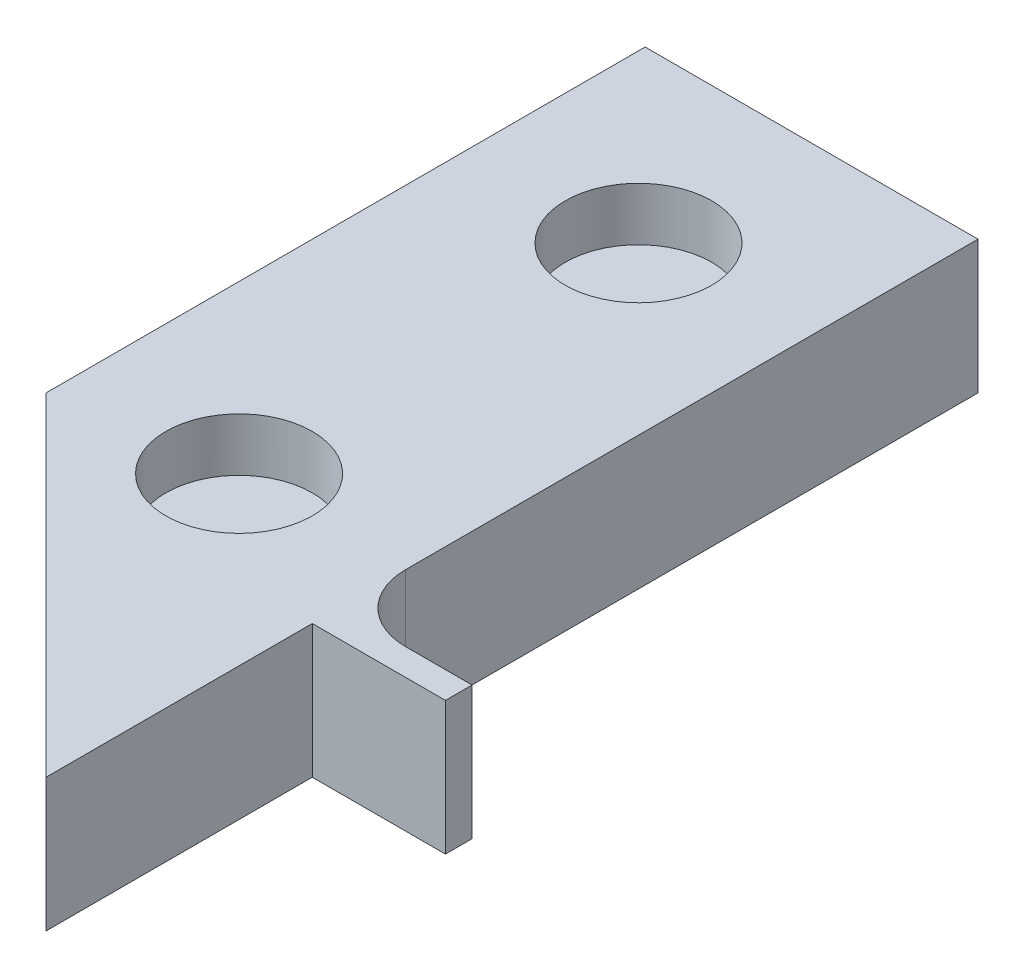
ISO-10303-21;
HEADER;
FILE_DESCRIPTION(('STEP AP214'),'2;1');
FILE_NAME('part.step','',(''),(''),'','','');
FILE_SCHEMA(('AUTOMOTIVE_DESIGN { 1 0 10303 214 1 1 1 1 }'));
ENDSEC;
DATA;
#1=APPLICATION_CONTEXT('core data for automotive mechanical design processes');
#2=APPLICATION_PROTOCOL_DEFINITION('international standard','automotive_design',2000,#1);
#3=PRODUCT_CONTEXT('',#1,'mechanical');
#4=PRODUCT('Part','Part','',(#3));
#5=PRODUCT_RELATED_PRODUCT_CATEGORY('part','',(#4));
#6=PRODUCT_DEFINITION_FORMATION('','',#4);
#7=PRODUCT_DEFINITION_CONTEXT('part definition',#1,'design');
#8=PRODUCT_DEFINITION('design','',#6,#7);
#9=PRODUCT_DEFINITION_SHAPE('','',#8);
#10=(LENGTH_UNIT() NAMED_UNIT(*) SI_UNIT(.MILLI.,.METRE.));
#11=(NAMED_UNIT(*) PLANE_ANGLE_UNIT() SI_UNIT($,.RADIAN.));
#12=(NAMED_UNIT(*) SI_UNIT($,.STERADIAN.) SOLID_ANGLE_UNIT());
#13=UNCERTAINTY_MEASURE_WITH_UNIT(LENGTH_MEASURE(1.E-05),#10,'distance_accuracy_value','');
#14=(GEOMETRIC_REPRESENTATION_CONTEXT(3) GLOBAL_UNCERTAINTY_ASSIGNED_CONTEXT((#13)) GLOBAL_UNIT_ASSIGNED_CONTEXT((#10,
#11,#12)) REPRESENTATION_CONTEXT('',''));
#15=CARTESIAN_POINT('',(0.,0.,0.));
#16=DIRECTION('',(0.,0.,1.));
#17=DIRECTION('',(1.,0.,0.));
#18=AXIS2_PLACEMENT_3D('',#15,#16,#17);
#19=CARTESIAN_POINT('',(0.,-20.,-140.));
#20=DIRECTION('',(-1.,0.,0.));
#21=DIRECTION('',(0.,0.,1.));
#22=AXIS2_PLACEMENT_3D('',#19,#20,#21);
#23=PLANE('',#22);
#24=DIRECTION('',(0.,1.,0.));
#25=VECTOR('',#24,1.);
#26=CARTESIAN_POINT('',(0.,-20.,-40.));
#27=LINE('',#26,#25);
#28=CARTESIAN_POINT('',(0.,-20.,-40.));
#29=VERTEX_POINT('',#28);
#30=CARTESIAN_POINT('',(0.,0.,-40.));
#31=VERTEX_POINT('',#30);
#32=EDGE_CURVE('E231',#29,#31,#27,.T.);
#33=ORIENTED_EDGE('',*,*,#32,.T.);
#34=DIRECTION('',(0.,0.,-1.));
#35=VECTOR('',#34,1.);
#36=CARTESIAN_POINT('',(0.,0.,-140.));
#37=LINE('',#36,#35);
#38=CARTESIAN_POINT('',(0.,0.,0.));
#39=VERTEX_POINT('',#38);
#40=EDGE_CURVE('E178',#39,#31,#37,.T.);
#41=ORIENTED_EDGE('',*,*,#40,.F.);
#42=DIRECTION('',(0.,1.,0.));
#43=VECTOR('',#42,1.);
#44=CARTESIAN_POINT('',(0.,-20.,0.));
#45=LINE('',#44,#43);
#46=CARTESIAN_POINT('',(0.,-20.,0.));
#47=VERTEX_POINT('',#46);
#48=EDGE_CURVE('E194',#47,#39,#45,.T.);
#49=ORIENTED_EDGE('',*,*,#48,.F.);
#50=DIRECTION('',(0.,0.,-1.));
#51=VECTOR('',#50,1.);
#52=CARTESIAN_POINT('',(0.,-20.,-140.));
#53=LINE('',#52,#51);
#54=EDGE_CURVE('E258',#47,#29,#53,.T.);
#55=ORIENTED_EDGE('',*,*,#54,.T.);
#56=EDGE_LOOP('',(#33,#41,#49,#55));
#57=FACE_BOUND('',#56,.T.);
#58=ADVANCED_FACE('F39',(#57),#23,.F.);
#59=CARTESIAN_POINT('',(0.,-20.,-54.));
#60=VERTEX_POINT('',#59);
#61=CARTESIAN_POINT('',(0.,-20.,-140.));
#62=VERTEX_POINT('',#61);
#63=EDGE_CURVE('E257',#60,#62,#53,.T.);
#64=ORIENTED_EDGE('',*,*,#63,.T.);
#65=DIRECTION('',(0.,1.,0.));
#66=VECTOR('',#65,1.);
#67=CARTESIAN_POINT('',(0.,-20.,-140.));
#68=LINE('',#67,#66);
#69=CARTESIAN_POINT('',(0.,0.,-140.));
#70=VERTEX_POINT('',#69);
#71=EDGE_CURVE('E177',#62,#70,#68,.T.);
#72=ORIENTED_EDGE('',*,*,#71,.T.);
#73=CARTESIAN_POINT('',(0.,0.,-54.));
#74=VERTEX_POINT('',#73);
#75=EDGE_CURVE('E174',#74,#70,#37,.T.);
#76=ORIENTED_EDGE('',*,*,#75,.F.);
#77=DIRECTION('',(0.,-1.,0.));
#78=VECTOR('',#77,1.);
#79=CARTESIAN_POINT('',(0.,0.,-54.));
#80=LINE('',#79,#78);
#81=EDGE_CURVE('E163',#60,#74,#80,.F.);
#82=ORIENTED_EDGE('',*,*,#81,.F.);
#83=EDGE_LOOP('',(#64,#72,#76,#82));
#84=FACE_BOUND('',#83,.T.);
#85=ADVANCED_FACE('F175',(#84),#23,.F.);
#86=CARTESIAN_POINT('',(-50.,-20.,-140.));
#87=DIRECTION('',(1.,0.,0.));
#88=DIRECTION('',(0.,0.,-1.));
#89=AXIS2_PLACEMENT_3D('',#86,#87,#88);
#90=PLANE('',#89);
#91=DIRECTION('',(0.,0.,1.));
#92=VECTOR('',#91,1.);
#93=CARTESIAN_POINT('',(-50.,0.,-140.));
#94=LINE('',#93,#92);
#95=CARTESIAN_POINT('',(-50.,0.,-140.));
#96=VERTEX_POINT('',#95);
#97=CARTESIAN_POINT('',(-50.,0.,-49.9999999999998));
#98=VERTEX_POINT('',#97);
#99=EDGE_CURVE('E183',#96,#98,#94,.T.);
#100=ORIENTED_EDGE('',*,*,#99,.F.);
#101=DIRECTION('',(0.,1.,0.));
#102=VECTOR('',#101,1.);
#103=CARTESIAN_POINT('',(-50.,-20.,-140.));
#104=LINE('',#103,#102);
#105=CARTESIAN_POINT('',(-50.,-20.,-140.));
#106=VERTEX_POINT('',#105);
#107=EDGE_CURVE('E189',#106,#96,#104,.T.);
#108=ORIENTED_EDGE('',*,*,#107,.F.);
#109=DIRECTION('',(0.,0.,1.));
#110=VECTOR('',#109,1.);
#111=CARTESIAN_POINT('',(-50.,-20.,-140.));
#112=LINE('',#111,#110);
#113=CARTESIAN_POINT('',(-50.,-20.,-49.9999999999998));
#114=VERTEX_POINT('',#113);
#115=EDGE_CURVE('E188',#106,#114,#112,.T.);
#116=ORIENTED_EDGE('',*,*,#115,.T.);
#117=DIRECTION('',(0.,1.,0.));
#118=VECTOR('',#117,1.);
#119=CARTESIAN_POINT('',(-50.,-20.,-49.9999999999998));
#120=LINE('',#119,#118);
#121=EDGE_CURVE('E197',#114,#98,#120,.T.);
#122=ORIENTED_EDGE('',*,*,#121,.T.);
#123=EDGE_LOOP('',(#100,#108,#116,#122));
#124=FACE_BOUND('',#123,.T.);
#125=ADVANCED_FACE('F266',(#124),#90,.F.);
#126=CARTESIAN_POINT('',(-50.,-20.,-49.9999999999998));
#127=DIRECTION('',(0.707106781186546,0.,-0.707106781186549));
#128=DIRECTION('',(-0.707106781186549,0.,-0.707106781186546));
#129=AXIS2_PLACEMENT_3D('',#126,#127,#128);
#130=PLANE('',#129);
#131=DIRECTION('',(-0.707106781186549,0.,-0.707106781186546));
#132=VECTOR('',#131,1.);
#133=CARTESIAN_POINT('',(-50.,-4.,-49.9999999999998));
#134=LINE('',#133,#132);
#135=CARTESIAN_POINT('',(-4.00000000000001,-4.,-4.));
#136=VERTEX_POINT('',#135);
#137=CARTESIAN_POINT('',(-46.,-4.,-45.9999999999998));
#138=VERTEX_POINT('',#137);
#139=EDGE_CURVE('E203',#136,#138,#134,.T.);
#140=ORIENTED_EDGE('',*,*,#139,.F.);
#141=DIRECTION('',(0.,-1.,0.));
#142=VECTOR('',#141,1.);
#143=CARTESIAN_POINT('',(-4.00000000000001,-20.,-4.));
#144=LINE('',#143,#142);
#145=CARTESIAN_POINT('',(-4.,-16.,-4.));
#146=VERTEX_POINT('',#145);
#147=EDGE_CURVE('E200',#136,#146,#144,.T.);
#148=ORIENTED_EDGE('',*,*,#147,.T.);
#149=DIRECTION('',(0.707106781186549,0.,0.707106781186546));
#150=VECTOR('',#149,1.);
#151=CARTESIAN_POINT('',(-50.,-16.,-49.9999999999998));
#152=LINE('',#151,#150);
#153=CARTESIAN_POINT('',(-46.,-16.,-45.9999999999998));
#154=VERTEX_POINT('',#153);
#155=EDGE_CURVE('E206',#154,#146,#152,.T.);
#156=ORIENTED_EDGE('',*,*,#155,.F.);
#157=DIRECTION('',(0.,-1.,0.));
#158=VECTOR('',#157,1.);
#159=CARTESIAN_POINT('',(-46.,-20.,-45.9999999999998));
#160=LINE('',#159,#158);
#161=EDGE_CURVE('E165',#138,#154,#160,.T.);
#162=ORIENTED_EDGE('',*,*,#161,.F.);
#163=EDGE_LOOP('',(#140,#148,#156,#162));
#164=FACE_BOUND('',#163,.T.);
#165=DIRECTION('',(0.707106781186549,0.,0.707106781186546));
#166=VECTOR('',#165,1.);
#167=CARTESIAN_POINT('',(-50.,0.,-49.9999999999998));
#168=LINE('',#167,#166);
#169=EDGE_CURVE('E179',#98,#39,#168,.T.);
#170=ORIENTED_EDGE('',*,*,#169,.F.);
#171=ORIENTED_EDGE('',*,*,#121,.F.);
#172=DIRECTION('',(0.707106781186549,0.,0.707106781186546));
#173=VECTOR('',#172,1.);
#174=CARTESIAN_POINT('',(-50.,-20.,-49.9999999999998));
#175=LINE('',#174,#173);
#176=EDGE_CURVE('E255',#114,#47,#175,.T.);
#177=ORIENTED_EDGE('',*,*,#176,.T.);
#178=ORIENTED_EDGE('',*,*,#48,.T.);
#179=EDGE_LOOP('',(#170,#171,#177,#178));
#180=FACE_BOUND('',#179,.T.);
#181=ADVANCED_FACE('F216',(#164,#180),#130,.F.);
#182=CARTESIAN_POINT('',(-50.,-20.,-140.));
#183=DIRECTION('',(0.,0.,1.));
#184=DIRECTION('',(1.,0.,0.));
#185=AXIS2_PLACEMENT_3D('',#182,#183,#184);
#186=PLANE('',#185);
#187=DIRECTION('',(-1.,0.,0.));
#188=VECTOR('',#187,1.);
#189=CARTESIAN_POINT('',(-50.,0.,-140.));
#190=LINE('',#189,#188);
#191=EDGE_CURVE('E182',#70,#96,#190,.T.);
#192=ORIENTED_EDGE('',*,*,#191,.F.);
#193=ORIENTED_EDGE('',*,*,#71,.F.);
#194=DIRECTION('',(-1.,0.,0.));
#195=VECTOR('',#194,1.);
#196=CARTESIAN_POINT('',(-50.,-20.,-140.));
#197=LINE('',#196,#195);
#198=EDGE_CURVE('E192',#62,#106,#197,.T.);
#199=ORIENTED_EDGE('',*,*,#198,.T.);
#200=ORIENTED_EDGE('',*,*,#107,.T.);
#201=EDGE_LOOP('',(#192,#193,#199,#200));
#202=FACE_BOUND('',#201,.T.);
#203=ADVANCED_FACE('F289',(#202),#186,.F.);
#204=CARTESIAN_POINT('',(0.,-20.,0.));
#205=DIRECTION('',(0.,-1.,0.));
#206=DIRECTION('',(0.,0.,1.));
#207=AXIS2_PLACEMENT_3D('',#204,#205,#206);
#208=PLANE('',#207);
#209=ORIENTED_EDGE('',*,*,#115,.F.);
#210=ORIENTED_EDGE('',*,*,#198,.F.);
#211=ORIENTED_EDGE('',*,*,#63,.F.);
#212=CARTESIAN_POINT('',(10.,-20.,-54.));
#213=DIRECTION('',(0.,1.,0.));
#214=DIRECTION('',(0.,0.,1.));
#215=AXIS2_PLACEMENT_3D('',#212,#213,#214);
#216=CIRCLE('',#215,10.);
#217=CARTESIAN_POINT('',(10.,-20.,-44.));
#218=VERTEX_POINT('',#217);
#219=EDGE_CURVE('E47',#218,#60,#216,.F.);
#220=ORIENTED_EDGE('',*,*,#219,.F.);
#221=DIRECTION('',(-1.,0.,0.));
#222=VECTOR('',#221,1.);
#223=CARTESIAN_POINT('',(20.,-20.,-44.));
#224=LINE('',#223,#222);
#225=CARTESIAN_POINT('',(20.,-20.,-44.));
#226=VERTEX_POINT('',#225);
#227=EDGE_CURVE('E246',#226,#218,#224,.T.);
#228=ORIENTED_EDGE('',*,*,#227,.F.);
#229=DIRECTION('',(0.,0.,1.));
#230=VECTOR('',#229,1.);
#231=CARTESIAN_POINT('',(20.,-20.,-40.));
#232=LINE('',#231,#230);
#233=CARTESIAN_POINT('',(20.,-20.,-40.));
#234=VERTEX_POINT('',#233);
#235=EDGE_CURVE('E239',#226,#234,#232,.T.);
#236=ORIENTED_EDGE('',*,*,#235,.T.);
#237=DIRECTION('',(-1.,0.,0.));
#238=VECTOR('',#237,1.);
#239=CARTESIAN_POINT('',(20.,-20.,-40.));
#240=LINE('',#239,#238);
#241=EDGE_CURVE('E242',#234,#29,#240,.T.);
#242=ORIENTED_EDGE('',*,*,#241,.T.);
#243=ORIENTED_EDGE('',*,*,#54,.F.);
#244=ORIENTED_EDGE('',*,*,#176,.F.);
#245=EDGE_LOOP('',(#209,#210,#211,#220,#228,#236,#242,#243,#244));
#246=FACE_BOUND('',#245,.T.);
#247=ADVANCED_FACE('F287',(#246),#208,.T.);
#248=CARTESIAN_POINT('',(0.,0.,0.));
#249=DIRECTION('',(0.,-1.,0.));
#250=DIRECTION('',(0.,0.,1.));
#251=AXIS2_PLACEMENT_3D('',#248,#249,#250);
#252=PLANE('',#251);
#253=CARTESIAN_POINT('',(-25.,0.,-54.));
#254=DIRECTION('',(0.,-1.,0.));
#255=DIRECTION('',(0.,0.,-1.));
#256=AXIS2_PLACEMENT_3D('',#253,#254,#255);
#257=CIRCLE('',#256,11.);
#258=CARTESIAN_POINT('',(-25.,0.,-65.));
#259=VERTEX_POINT('',#258);
#260=EDGE_CURVE('E149',#259,#259,#257,.T.);
#261=ORIENTED_EDGE('',*,*,#260,.T.);
#262=EDGE_LOOP('',(#261));
#263=FACE_BOUND('',#262,.T.);
#264=CARTESIAN_POINT('',(-25.,0.,-114.));
#265=DIRECTION('',(0.,-1.,0.));
#266=DIRECTION('',(0.,0.,-1.));
#267=AXIS2_PLACEMENT_3D('',#264,#265,#266);
#268=CIRCLE('',#267,11.);
#269=CARTESIAN_POINT('',(-25.,0.,-125.));
#270=VERTEX_POINT('',#269);
#271=EDGE_CURVE('E444',#270,#270,#268,.T.);
#272=ORIENTED_EDGE('',*,*,#271,.T.);
#273=EDGE_LOOP('',(#272));
#274=FACE_BOUND('',#273,.T.);
#275=ORIENTED_EDGE('',*,*,#99,.T.);
#276=ORIENTED_EDGE('',*,*,#169,.T.);
#277=ORIENTED_EDGE('',*,*,#40,.T.);
#278=DIRECTION('',(-1.,0.,0.));
#279=VECTOR('',#278,1.);
#280=CARTESIAN_POINT('',(20.,0.,-40.));
#281=LINE('',#280,#279);
#282=CARTESIAN_POINT('',(20.,0.,-40.));
#283=VERTEX_POINT('',#282);
#284=EDGE_CURVE('E251',#283,#31,#281,.T.);
#285=ORIENTED_EDGE('',*,*,#284,.F.);
#286=DIRECTION('',(0.,0.,-1.));
#287=VECTOR('',#286,1.);
#288=CARTESIAN_POINT('',(20.,0.,-40.));
#289=LINE('',#288,#287);
#290=CARTESIAN_POINT('',(20.,0.,-44.));
#291=VERTEX_POINT('',#290);
#292=EDGE_CURVE('E234',#283,#291,#289,.T.);
#293=ORIENTED_EDGE('',*,*,#292,.T.);
#294=DIRECTION('',(-1.,0.,0.));
#295=VECTOR('',#294,1.);
#296=CARTESIAN_POINT('',(20.,0.,-44.));
#297=LINE('',#296,#295);
#298=CARTESIAN_POINT('',(10.,0.,-44.));
#299=VERTEX_POINT('',#298);
#300=EDGE_CURVE('E249',#291,#299,#297,.T.);
#301=ORIENTED_EDGE('',*,*,#300,.T.);
#302=CARTESIAN_POINT('',(10.,0.,-54.));
#303=DIRECTION('',(0.,1.,0.));
#304=DIRECTION('',(0.,0.,1.));
#305=AXIS2_PLACEMENT_3D('',#302,#303,#304);
#306=CIRCLE('',#305,10.);
#307=EDGE_CURVE('E12',#74,#299,#306,.T.);
#308=ORIENTED_EDGE('',*,*,#307,.F.);
#309=ORIENTED_EDGE('',*,*,#75,.T.);
#310=ORIENTED_EDGE('',*,*,#191,.T.);
#311=EDGE_LOOP('',(#275,#276,#277,#285,#293,#301,#308,#309,#310));
#312=FACE_BOUND('',#311,.T.);
#313=ADVANCED_FACE('F263',(#263,#274,#312),#252,.F.);
#314=CARTESIAN_POINT('',(20.,-20.,-40.));
#315=DIRECTION('',(0.,0.,-1.));
#316=DIRECTION('',(-1.,0.,0.));
#317=AXIS2_PLACEMENT_3D('',#314,#315,#316);
#318=PLANE('',#317);
#319=ORIENTED_EDGE('',*,*,#32,.F.);
#320=ORIENTED_EDGE('',*,*,#241,.F.);
#321=DIRECTION('',(0.,1.,0.));
#322=VECTOR('',#321,1.);
#323=CARTESIAN_POINT('',(20.,-20.,-40.));
#324=LINE('',#323,#322);
#325=EDGE_CURVE('E232',#234,#283,#324,.T.);
#326=ORIENTED_EDGE('',*,*,#325,.T.);
#327=ORIENTED_EDGE('',*,*,#284,.T.);
#328=EDGE_LOOP('',(#319,#320,#326,#327));
#329=FACE_BOUND('',#328,.T.);
#330=ADVANCED_FACE('F277',(#329),#318,.F.);
#331=CARTESIAN_POINT('',(20.,-20.,-44.));
#332=DIRECTION('',(0.,0.,1.));
#333=DIRECTION('',(1.,0.,0.));
#334=AXIS2_PLACEMENT_3D('',#331,#332,#333);
#335=PLANE('',#334);
#336=ORIENTED_EDGE('',*,*,#300,.F.);
#337=DIRECTION('',(0.,-1.,0.));
#338=VECTOR('',#337,1.);
#339=CARTESIAN_POINT('',(20.,-20.,-44.));
#340=LINE('',#339,#338);
#341=EDGE_CURVE('E237',#291,#226,#340,.T.);
#342=ORIENTED_EDGE('',*,*,#341,.T.);
#343=ORIENTED_EDGE('',*,*,#227,.T.);
#344=DIRECTION('',(0.,-1.,0.));
#345=VECTOR('',#344,1.);
#346=CARTESIAN_POINT('',(10.,-20.,-44.));
#347=LINE('',#346,#345);
#348=EDGE_CURVE('E160',#299,#218,#347,.T.);
#349=ORIENTED_EDGE('',*,*,#348,.F.);
#350=EDGE_LOOP('',(#336,#342,#343,#349));
#351=FACE_BOUND('',#350,.T.);
#352=ADVANCED_FACE('F285',(#351),#335,.F.);
#353=CARTESIAN_POINT('',(20.,0.,0.));
#354=DIRECTION('',(1.,0.,0.));
#355=DIRECTION('',(0.,0.,-1.));
#356=AXIS2_PLACEMENT_3D('',#353,#354,#355);
#357=PLANE('',#356);
#358=ORIENTED_EDGE('',*,*,#325,.F.);
#359=ORIENTED_EDGE('',*,*,#235,.F.);
#360=ORIENTED_EDGE('',*,*,#341,.F.);
#361=ORIENTED_EDGE('',*,*,#292,.F.);
#362=EDGE_LOOP('',(#358,#359,#360,#361));
#363=FACE_BOUND('',#362,.T.);
#364=ADVANCED_FACE('F281',(#363),#357,.T.);
#365=CARTESIAN_POINT('',(47.5394572960187,-16.,-45.9999999999998));
#366=DIRECTION('',(0.,0.,-1.));
#367=DIRECTION('',(-1.,0.,0.));
#368=AXIS2_PLACEMENT_3D('',#365,#366,#367);
#369=PLANE('',#368);
#370=DIRECTION('',(-1.,0.,0.));
#371=VECTOR('',#370,1.);
#372=CARTESIAN_POINT('',(47.5394572960187,-8.,-45.9999999999998));
#373=LINE('',#372,#371);
#374=CARTESIAN_POINT('',(-17.4501655647295,-8.,-45.9999999999998));
#375=VERTEX_POINT('',#374);
#376=CARTESIAN_POINT('',(-32.5498344352705,-8.,-45.9999999999998));
#377=VERTEX_POINT('',#376);
#378=EDGE_CURVE('E153',#375,#377,#373,.T.);
#379=ORIENTED_EDGE('',*,*,#378,.T.);
#380=DIRECTION('',(0.,1.,0.));
#381=VECTOR('',#380,1.);
#382=CARTESIAN_POINT('',(-32.5498344352705,-8.,-45.9999999999998));
#383=LINE('',#382,#381);
#384=CARTESIAN_POINT('',(-32.5498344352705,-4.,-45.9999999999998));
#385=VERTEX_POINT('',#384);
#386=EDGE_CURVE('E145',#385,#377,#383,.F.);
#387=ORIENTED_EDGE('',*,*,#386,.F.);
#388=DIRECTION('',(-1.,0.,0.));
#389=VECTOR('',#388,1.);
#390=CARTESIAN_POINT('',(47.5394572960187,-4.,-45.9999999999998));
#391=LINE('',#390,#389);
#392=EDGE_CURVE('E157',#385,#138,#391,.T.);
#393=ORIENTED_EDGE('',*,*,#392,.T.);
#394=ORIENTED_EDGE('',*,*,#161,.T.);
#395=DIRECTION('',(-1.,0.,0.));
#396=VECTOR('',#395,1.);
#397=CARTESIAN_POINT('',(47.5394572960187,-16.,-45.9999999999998));
#398=LINE('',#397,#396);
#399=CARTESIAN_POINT('',(-4.,-16.,-45.9999999999998));
#400=VERTEX_POINT('',#399);
#401=EDGE_CURVE('E212',#400,#154,#398,.T.);
#402=ORIENTED_EDGE('',*,*,#401,.F.);
#403=DIRECTION('',(0.,-1.,0.));
#404=VECTOR('',#403,1.);
#405=CARTESIAN_POINT('',(-4.,-16.,-45.9999999999998));
#406=LINE('',#405,#404);
#407=CARTESIAN_POINT('',(-4.,-4.,-45.9999999999998));
#408=VERTEX_POINT('',#407);
#409=EDGE_CURVE('E224',#408,#400,#406,.T.);
#410=ORIENTED_EDGE('',*,*,#409,.F.);
#411=CARTESIAN_POINT('',(-17.4501655647295,-4.,-45.9999999999998));
#412=VERTEX_POINT('',#411);
#413=EDGE_CURVE('E156',#408,#412,#391,.T.);
#414=ORIENTED_EDGE('',*,*,#413,.T.);
#415=DIRECTION('',(0.,1.,0.));
#416=VECTOR('',#415,1.);
#417=CARTESIAN_POINT('',(-17.4501655647295,-8.,-45.9999999999998));
#418=LINE('',#417,#416);
#419=EDGE_CURVE('E142',#375,#412,#418,.T.);
#420=ORIENTED_EDGE('',*,*,#419,.F.);
#421=EDGE_LOOP('',(#379,#387,#393,#394,#402,#410,#414,#420));
#422=FACE_BOUND('',#421,.T.);
#423=ADVANCED_FACE('F152',(#422),#369,.F.);
#424=CARTESIAN_POINT('',(47.5394572960187,-16.,-45.9999999999998));
#425=DIRECTION('',(0.,-1.,0.));
#426=DIRECTION('',(0.,0.,1.));
#427=AXIS2_PLACEMENT_3D('',#424,#425,#426);
#428=PLANE('',#427);
#429=ORIENTED_EDGE('',*,*,#401,.T.);
#430=ORIENTED_EDGE('',*,*,#155,.T.);
#431=DIRECTION('',(0.,0.,1.));
#432=VECTOR('',#431,1.);
#433=CARTESIAN_POINT('',(-4.,-16.,-45.9999999999998));
#434=LINE('',#433,#432);
#435=EDGE_CURVE('E221',#400,#146,#434,.T.);
#436=ORIENTED_EDGE('',*,*,#435,.F.);
#437=EDGE_LOOP('',(#429,#430,#436));
#438=FACE_BOUND('',#437,.T.);
#439=ADVANCED_FACE('F220',(#438),#428,.F.);
#440=CARTESIAN_POINT('',(47.5394572960187,-4.,-45.9999999999998));
#441=DIRECTION('',(0.,1.,0.));
#442=DIRECTION('',(0.,0.,-1.));
#443=AXIS2_PLACEMENT_3D('',#440,#441,#442);
#444=PLANE('',#443);
#445=ORIENTED_EDGE('',*,*,#413,.F.);
#446=DIRECTION('',(0.,0.,-1.));
#447=VECTOR('',#446,1.);
#448=CARTESIAN_POINT('',(-4.,-4.,-45.9999999999998));
#449=LINE('',#448,#447);
#450=EDGE_CURVE('E229',#136,#408,#449,.T.);
#451=ORIENTED_EDGE('',*,*,#450,.F.);
#452=ORIENTED_EDGE('',*,*,#139,.T.);
#453=ORIENTED_EDGE('',*,*,#392,.F.);
#454=CARTESIAN_POINT('',(-25.,-4.,-54.));
#455=DIRECTION('',(0.,-1.,0.));
#456=DIRECTION('',(0.,0.,-1.));
#457=AXIS2_PLACEMENT_3D('',#454,#455,#456);
#458=CIRCLE('',#457,11.);
#459=EDGE_CURVE('E161',#412,#385,#458,.T.);
#460=ORIENTED_EDGE('',*,*,#459,.F.);
#461=EDGE_LOOP('',(#445,#451,#452,#453,#460));
#462=FACE_BOUND('',#461,.T.);
#463=ADVANCED_FACE('F374',(#462),#444,.F.);
#464=CARTESIAN_POINT('',(-4.,-20.,-140.));
#465=DIRECTION('',(-1.,0.,0.));
#466=DIRECTION('',(0.,0.,1.));
#467=AXIS2_PLACEMENT_3D('',#464,#465,#466);
#468=PLANE('',#467);
#469=ORIENTED_EDGE('',*,*,#147,.F.);
#470=ORIENTED_EDGE('',*,*,#450,.T.);
#471=ORIENTED_EDGE('',*,*,#409,.T.);
#472=ORIENTED_EDGE('',*,*,#435,.T.);
#473=EDGE_LOOP('',(#469,#470,#471,#472));
#474=FACE_BOUND('',#473,.T.);
#475=ADVANCED_FACE('F383',(#474),#468,.T.);
#476=CARTESIAN_POINT('',(-25.,-8.,-54.));
#477=DIRECTION('',(0.,1.,0.));
#478=DIRECTION('',(0.,0.,-1.));
#479=AXIS2_PLACEMENT_3D('',#476,#477,#478);
#480=PLANE('',#479);
#481=ORIENTED_EDGE('',*,*,#378,.F.);
#482=CARTESIAN_POINT('',(-25.,-8.,-54.));
#483=DIRECTION('',(0.,-1.,0.));
#484=DIRECTION('',(0.,0.,-1.));
#485=AXIS2_PLACEMENT_3D('',#482,#483,#484);
#486=CIRCLE('',#485,11.);
#487=EDGE_CURVE('E139',#377,#375,#486,.T.);
#488=ORIENTED_EDGE('',*,*,#487,.F.);
#489=EDGE_LOOP('',(#481,#488));
#490=FACE_BOUND('',#489,.T.);
#491=ADVANCED_FACE('F159',(#490),#480,.T.);
#492=CARTESIAN_POINT('',(-25.,-8.,-54.));
#493=DIRECTION('',(0.,1.,0.));
#494=DIRECTION('',(0.,0.,-1.));
#495=AXIS2_PLACEMENT_3D('',#492,#493,#494);
#496=CYLINDRICAL_SURFACE('',#495,11.);
#497=ORIENTED_EDGE('',*,*,#260,.F.);
#498=EDGE_LOOP('',(#497));
#499=FACE_BOUND('',#498,.T.);
#500=ORIENTED_EDGE('',*,*,#487,.T.);
#501=ORIENTED_EDGE('',*,*,#419,.T.);
#502=ORIENTED_EDGE('',*,*,#459,.T.);
#503=ORIENTED_EDGE('',*,*,#386,.T.);
#504=EDGE_LOOP('',(#500,#501,#502,#503));
#505=FACE_BOUND('',#504,.T.);
#506=ADVANCED_FACE('F141',(#499,#505),#496,.F.);
#507=CARTESIAN_POINT('',(-25.,-8.,-114.));
#508=DIRECTION('',(0.,1.,0.));
#509=DIRECTION('',(0.,0.,-1.));
#510=AXIS2_PLACEMENT_3D('',#507,#508,#509);
#511=CYLINDRICAL_SURFACE('',#510,11.);
#512=CARTESIAN_POINT('',(-25.,-8.,-114.));
#513=DIRECTION('',(0.,-1.,0.));
#514=DIRECTION('',(0.,0.,-1.));
#515=AXIS2_PLACEMENT_3D('',#512,#513,#514);
#516=CIRCLE('',#515,11.);
#517=CARTESIAN_POINT('',(-25.,-8.,-125.));
#518=VERTEX_POINT('',#517);
#519=EDGE_CURVE('E443',#518,#518,#516,.T.);
#520=ORIENTED_EDGE('',*,*,#519,.T.);
#521=EDGE_LOOP('',(#520));
#522=FACE_BOUND('',#521,.T.);
#523=ORIENTED_EDGE('',*,*,#271,.F.);
#524=EDGE_LOOP('',(#523));
#525=FACE_BOUND('',#524,.T.);
#526=ADVANCED_FACE('F410',(#522,#525),#511,.F.);
#527=CARTESIAN_POINT('',(-25.,-8.,-114.));
#528=DIRECTION('',(0.,1.,0.));
#529=DIRECTION('',(0.,0.,-1.));
#530=AXIS2_PLACEMENT_3D('',#527,#528,#529);
#531=PLANE('',#530);
#532=ORIENTED_EDGE('',*,*,#519,.F.);
#533=EDGE_LOOP('',(#532));
#534=FACE_BOUND('',#533,.T.);
#535=ADVANCED_FACE('F420',(#534),#531,.T.);
#536=CARTESIAN_POINT('',(10.,-20.,-54.));
#537=DIRECTION('',(0.,1.,0.));
#538=DIRECTION('',(0.,0.,-1.));
#539=AXIS2_PLACEMENT_3D('',#536,#537,#538);
#540=CYLINDRICAL_SURFACE('',#539,10.);
#541=ORIENTED_EDGE('',*,*,#307,.T.);
#542=ORIENTED_EDGE('',*,*,#348,.T.);
#543=ORIENTED_EDGE('',*,*,#219,.T.);
#544=ORIENTED_EDGE('',*,*,#81,.T.);
#545=EDGE_LOOP('',(#541,#542,#543,#544));
#546=FACE_BOUND('',#545,.T.);
#547=ADVANCED_FACE('F41',(#546),#540,.F.);
#548=CLOSED_SHELL('',(#58,#85,#125,#181,#203,#247,#313,#330,#352,#364,#423,#439,#463,#475,#491,
#506,#526,#535,#547));
#549=MANIFOLD_SOLID_BREP('B2',#548);
#550=ADVANCED_BREP_SHAPE_REPRESENTATION('',(#18,#549),#14);
#551=SHAPE_DEFINITION_REPRESENTATION(#9,#550);
ENDSEC;
END-ISO-10303-21;
